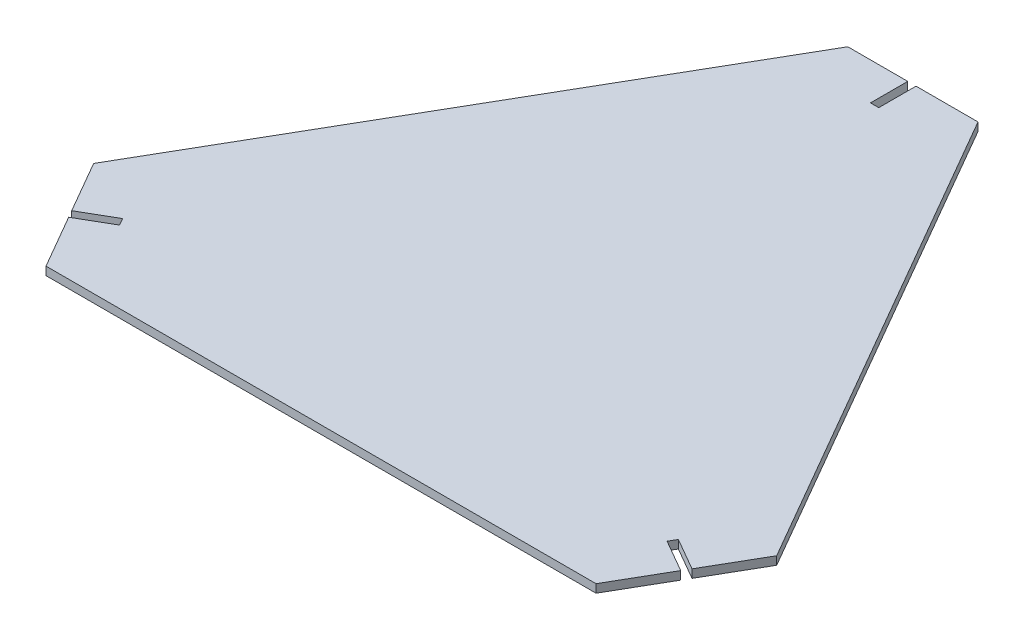
ISO-10303-21;
HEADER;
FILE_DESCRIPTION(('STEP AP214'),'2;1');
FILE_NAME('part.step','',(''),(''),'','','');
FILE_SCHEMA(('AUTOMOTIVE_DESIGN { 1 0 10303 214 1 1 1 1 }'));
ENDSEC;
DATA;
#1=APPLICATION_CONTEXT('core data for automotive mechanical design processes');
#2=APPLICATION_PROTOCOL_DEFINITION('international standard','automotive_design',2000,#1);
#3=PRODUCT_CONTEXT('',#1,'mechanical');
#4=PRODUCT('Part','Part','',(#3));
#5=PRODUCT_RELATED_PRODUCT_CATEGORY('part','',(#4));
#6=PRODUCT_DEFINITION_FORMATION('','',#4);
#7=PRODUCT_DEFINITION_CONTEXT('part definition',#1,'design');
#8=PRODUCT_DEFINITION('design','',#6,#7);
#9=PRODUCT_DEFINITION_SHAPE('','',#8);
#10=(LENGTH_UNIT() NAMED_UNIT(*) SI_UNIT(.MILLI.,.METRE.));
#11=(NAMED_UNIT(*) PLANE_ANGLE_UNIT() SI_UNIT($,.RADIAN.));
#12=(NAMED_UNIT(*) SI_UNIT($,.STERADIAN.) SOLID_ANGLE_UNIT());
#13=UNCERTAINTY_MEASURE_WITH_UNIT(LENGTH_MEASURE(1.E-05),#10,'distance_accuracy_value','');
#14=(GEOMETRIC_REPRESENTATION_CONTEXT(3) GLOBAL_UNCERTAINTY_ASSIGNED_CONTEXT((#13)) GLOBAL_UNIT_ASSIGNED_CONTEXT((#10,
#11,#12)) REPRESENTATION_CONTEXT('',''));
#15=CARTESIAN_POINT('',(0.,0.,0.));
#16=DIRECTION('',(0.,0.,1.));
#17=DIRECTION('',(1.,0.,0.));
#18=AXIS2_PLACEMENT_3D('',#15,#16,#17);
#19=CARTESIAN_POINT('',(112.583302491977,1.5,85.));
#20=DIRECTION('',(0.,0.,-1.));
#21=DIRECTION('',(-1.,0.,0.));
#22=AXIS2_PLACEMENT_3D('',#19,#20,#21);
#23=PLANE('',#22);
#24=DIRECTION('',(1.,0.,0.));
#25=VECTOR('',#24,1.);
#26=CARTESIAN_POINT('',(112.583302491977,1.5,85.));
#27=LINE('',#26,#25);
#28=CARTESIAN_POINT('',(-100.042489853198,1.5,85.));
#29=VERTEX_POINT('',#28);
#30=CARTESIAN_POINT('',(99.3042463006157,1.5,85.));
#31=VERTEX_POINT('',#30);
#32=EDGE_CURVE('E172',#29,#31,#27,.T.);
#33=ORIENTED_EDGE('',*,*,#32,.F.);
#34=DIRECTION('',(0.,1.,0.));
#35=VECTOR('',#34,1.);
#36=CARTESIAN_POINT('',(-100.042489853198,-1.501,85.));
#37=LINE('',#36,#35);
#38=CARTESIAN_POINT('',(-100.042489853198,-1.5,85.));
#39=VERTEX_POINT('',#38);
#40=EDGE_CURVE('E183',#39,#29,#37,.T.);
#41=ORIENTED_EDGE('',*,*,#40,.F.);
#42=DIRECTION('',(1.,0.,0.));
#43=VECTOR('',#42,1.);
#44=CARTESIAN_POINT('',(112.583302491977,-1.5,85.));
#45=LINE('',#44,#43);
#46=CARTESIAN_POINT('',(99.3042463006157,-1.5,85.));
#47=VERTEX_POINT('',#46);
#48=EDGE_CURVE('E209',#39,#47,#45,.T.);
#49=ORIENTED_EDGE('',*,*,#48,.T.);
#50=DIRECTION('',(0.,1.,0.));
#51=VECTOR('',#50,1.);
#52=CARTESIAN_POINT('',(99.3042463006157,-1.501,85.));
#53=LINE('',#52,#51);
#54=EDGE_CURVE('E194',#47,#31,#53,.T.);
#55=ORIENTED_EDGE('',*,*,#54,.T.);
#56=EDGE_LOOP('',(#33,#41,#49,#55));
#57=FACE_BOUND('',#56,.T.);
#58=ADVANCED_FACE('F40',(#57),#23,.F.);
#59=CARTESIAN_POINT('',(17.3205080756888,1.5,-140.));
#60=DIRECTION('',(-0.866025403784439,0.,0.5));
#61=DIRECTION('',(0.5,0.,0.866025403784439));
#62=AXIS2_PLACEMENT_3D('',#59,#60,#61);
#63=PLANE('',#62);
#64=DIRECTION('',(-0.5,0.,-0.866025403784438));
#65=VECTOR('',#64,1.);
#66=CARTESIAN_POINT('',(17.3205080756888,-1.5,-140.));
#67=LINE('',#66,#65);
#68=CARTESIAN_POINT('',(123.264282471985,-1.5,43.5));
#69=VERTEX_POINT('',#68);
#70=CARTESIAN_POINT('',(23.5909143950783,-1.5,-129.139337670716));
#71=VERTEX_POINT('',#70);
#72=EDGE_CURVE('E204',#69,#71,#67,.T.);
#73=ORIENTED_EDGE('',*,*,#72,.T.);
#74=DIRECTION('',(0.,1.,0.));
#75=VECTOR('',#74,1.);
#76=CARTESIAN_POINT('',(23.5909143950783,-1.501,-129.139337670716));
#77=LINE('',#76,#75);
#78=CARTESIAN_POINT('',(23.5909143950783,1.5,-129.139337670716));
#79=VERTEX_POINT('',#78);
#80=EDGE_CURVE('E190',#71,#79,#77,.T.);
#81=ORIENTED_EDGE('',*,*,#80,.T.);
#82=DIRECTION('',(-0.5,0.,-0.866025403784438));
#83=VECTOR('',#82,1.);
#84=CARTESIAN_POINT('',(17.3205080756888,1.5,-140.));
#85=LINE('',#84,#83);
#86=CARTESIAN_POINT('',(123.264282471985,1.5,43.5));
#87=VERTEX_POINT('',#86);
#88=EDGE_CURVE('E49',#87,#79,#85,.T.);
#89=ORIENTED_EDGE('',*,*,#88,.F.);
#90=DIRECTION('',(0.,1.,0.));
#91=VECTOR('',#90,1.);
#92=CARTESIAN_POINT('',(123.264282471985,-1.501,43.5));
#93=LINE('',#92,#91);
#94=EDGE_CURVE('E221',#69,#87,#93,.T.);
#95=ORIENTED_EDGE('',*,*,#94,.F.);
#96=EDGE_LOOP('',(#73,#81,#89,#95));
#97=FACE_BOUND('',#96,.T.);
#98=ADVANCED_FACE('F217',(#97),#63,.F.);
#99=CARTESIAN_POINT('',(-129.903810567666,1.5,55.));
#100=DIRECTION('',(0.866025403784439,0.,0.5));
#101=DIRECTION('',(0.5,0.,-0.866025403784439));
#102=AXIS2_PLACEMENT_3D('',#99,#100,#101);
#103=PLANE('',#102);
#104=DIRECTION('',(-0.5,0.,0.866025403784439));
#105=VECTOR('',#104,1.);
#106=CARTESIAN_POINT('',(-129.903810567666,-1.5,55.));
#107=LINE('',#106,#105);
#108=CARTESIAN_POINT('',(-23.5909143950782,-1.5,-129.139337670716));
#109=VERTEX_POINT('',#108);
#110=CARTESIAN_POINT('',(-123.633404248276,-1.5,44.1393376707166));
#111=VERTEX_POINT('',#110);
#112=EDGE_CURVE('E43',#109,#111,#107,.T.);
#113=ORIENTED_EDGE('',*,*,#112,.T.);
#114=DIRECTION('',(0.,1.,0.));
#115=VECTOR('',#114,1.);
#116=CARTESIAN_POINT('',(-123.633404248276,-1.501,44.1393376707166));
#117=LINE('',#116,#115);
#118=CARTESIAN_POINT('',(-123.633404248276,1.5,44.1393376707166));
#119=VERTEX_POINT('',#118);
#120=EDGE_CURVE('E276',#111,#119,#117,.T.);
#121=ORIENTED_EDGE('',*,*,#120,.T.);
#122=DIRECTION('',(-0.5,0.,0.866025403784439));
#123=VECTOR('',#122,1.);
#124=CARTESIAN_POINT('',(-129.903810567666,1.5,55.));
#125=LINE('',#124,#123);
#126=CARTESIAN_POINT('',(-23.5909143950782,1.5,-129.139337670716));
#127=VERTEX_POINT('',#126);
#128=EDGE_CURVE('E11',#127,#119,#125,.T.);
#129=ORIENTED_EDGE('',*,*,#128,.F.);
#130=DIRECTION('',(0.,1.,0.));
#131=VECTOR('',#130,1.);
#132=CARTESIAN_POINT('',(-23.5909143950782,-1.501,-129.139337670716));
#133=LINE('',#132,#131);
#134=EDGE_CURVE('E254',#109,#127,#133,.T.);
#135=ORIENTED_EDGE('',*,*,#134,.F.);
#136=EDGE_LOOP('',(#113,#121,#129,#135));
#137=FACE_BOUND('',#136,.T.);
#138=ADVANCED_FACE('F406',(#137),#103,.F.);
#139=CARTESIAN_POINT('',(-112.583302491977,1.5,65.));
#140=DIRECTION('',(0.,1.,0.));
#141=DIRECTION('',(0.,0.,1.));
#142=AXIS2_PLACEMENT_3D('',#139,#140,#141);
#143=PLANE('',#142);
#144=ORIENTED_EDGE('',*,*,#128,.T.);
#145=DIRECTION('',(-0.500000000000009,0.,-0.866025403784433));
#146=VECTOR('',#145,1.);
#147=CARTESIAN_POINT('',(-114.522507938882,1.5,59.9198729810788));
#148=LINE('',#147,#146);
#149=CARTESIAN_POINT('',(-112.772507938882,1.5,62.9509618943242));
#150=VERTEX_POINT('',#149);
#151=EDGE_CURVE('E180',#150,#119,#148,.T.);
#152=ORIENTED_EDGE('',*,*,#151,.F.);
#153=DIRECTION('',(-0.866025403784434,0.,0.500000000000008));
#154=VECTOR('',#153,1.);
#155=CARTESIAN_POINT('',(-101.081164987792,1.5,56.2009618943242));
#156=LINE('',#155,#154);
#157=CARTESIAN_POINT('',(-101.081164987792,1.5,56.2009618943242));
#158=VERTEX_POINT('',#157);
#159=EDGE_CURVE('E291',#158,#150,#156,.T.);
#160=ORIENTED_EDGE('',*,*,#159,.F.);
#161=DIRECTION('',(-0.500000000000006,0.,-0.866025403784435));
#162=VECTOR('',#161,1.);
#163=CARTESIAN_POINT('',(-99.5811649877924,1.5,58.7990381056775));
#164=LINE('',#163,#162);
#165=CARTESIAN_POINT('',(-99.5811649877924,1.5,58.7990381056775));
#166=VERTEX_POINT('',#165);
#167=EDGE_CURVE('E57',#166,#158,#164,.T.);
#168=ORIENTED_EDGE('',*,*,#167,.F.);
#169=DIRECTION('',(0.866025403784434,0.,-0.500000000000008));
#170=VECTOR('',#169,1.);
#171=CARTESIAN_POINT('',(-108.241419025637,1.5,63.7990381056776));
#172=LINE('',#171,#170);
#173=CARTESIAN_POINT('',(-111.272507938882,1.5,65.5490381056776));
#174=VERTEX_POINT('',#173);
#175=EDGE_CURVE('E174',#174,#166,#172,.T.);
#176=ORIENTED_EDGE('',*,*,#175,.F.);
#177=DIRECTION('',(-0.500000000000008,0.,-0.866025403784434));
#178=VECTOR('',#177,1.);
#179=CARTESIAN_POINT('',(-104.522507938882,1.5,77.2403810567675));
#180=LINE('',#179,#178);
#181=EDGE_CURVE('E167',#29,#174,#180,.T.);
#182=ORIENTED_EDGE('',*,*,#181,.F.);
#183=ORIENTED_EDGE('',*,*,#32,.T.);
#184=DIRECTION('',(-0.499999999999999,0.,0.866025403784439));
#185=VECTOR('',#184,1.);
#186=CARTESIAN_POINT('',(108.7842643863,1.5,68.5801270189222));
#187=LINE('',#186,#185);
#188=CARTESIAN_POINT('',(110.5342643863,1.5,65.5490381056767));
#189=VERTEX_POINT('',#188);
#190=EDGE_CURVE('E341',#189,#31,#187,.T.);
#191=ORIENTED_EDGE('',*,*,#190,.F.);
#192=DIRECTION('',(0.866025403784439,0.,0.5));
#193=VECTOR('',#192,1.);
#194=CARTESIAN_POINT('',(98.8429214352104,1.5,58.7990381056767));
#195=LINE('',#194,#193);
#196=CARTESIAN_POINT('',(98.8429214352104,1.5,58.7990381056767));
#197=VERTEX_POINT('',#196);
#198=EDGE_CURVE('E359',#197,#189,#195,.T.);
#199=ORIENTED_EDGE('',*,*,#198,.F.);
#200=DIRECTION('',(-0.500000000000002,0.,0.866025403784438));
#201=VECTOR('',#200,1.);
#202=CARTESIAN_POINT('',(100.34292143521,1.5,56.2009618943233));
#203=LINE('',#202,#201);
#204=CARTESIAN_POINT('',(100.34292143521,1.5,56.2009618943233));
#205=VERTEX_POINT('',#204);
#206=EDGE_CURVE('E356',#205,#197,#203,.T.);
#207=ORIENTED_EDGE('',*,*,#206,.F.);
#208=DIRECTION('',(-0.866025403784438,0.,-0.5));
#209=VECTOR('',#208,1.);
#210=CARTESIAN_POINT('',(109.003175473055,1.5,61.2009618943233));
#211=LINE('',#210,#209);
#212=CARTESIAN_POINT('',(112.0342643863,1.5,62.9509618943233));
#213=VERTEX_POINT('',#212);
#214=EDGE_CURVE('E362',#213,#205,#211,.T.);
#215=ORIENTED_EDGE('',*,*,#214,.F.);
#216=DIRECTION('',(-0.5,0.,0.866025403784439));
#217=VECTOR('',#216,1.);
#218=CARTESIAN_POINT('',(118.7842643863,1.5,51.2596189432334));
#219=LINE('',#218,#217);
#220=EDGE_CURVE('E337',#87,#213,#219,.T.);
#221=ORIENTED_EDGE('',*,*,#220,.F.);
#222=ORIENTED_EDGE('',*,*,#88,.T.);
#223=DIRECTION('',(1.,0.,0.));
#224=VECTOR('',#223,1.);
#225=CARTESIAN_POINT('',(4.63087822370822,1.5,-129.139337670717));
#226=LINE('',#225,#224);
#227=CARTESIAN_POINT('',(1.13087822370836,1.5,-129.139337670717));
#228=VERTEX_POINT('',#227);
#229=EDGE_CURVE('E237',#228,#79,#226,.T.);
#230=ORIENTED_EDGE('',*,*,#229,.F.);
#231=DIRECTION('',(0.,0.,-1.));
#232=VECTOR('',#231,1.);
#233=CARTESIAN_POINT('',(1.1308782237083,1.5,-115.639337670717));
#234=LINE('',#233,#232);
#235=CARTESIAN_POINT('',(1.13087822370829,1.5,-115.639337670717));
#236=VERTEX_POINT('',#235);
#237=EDGE_CURVE('E321',#236,#228,#234,.T.);
#238=ORIENTED_EDGE('',*,*,#237,.F.);
#239=DIRECTION('',(1.,0.,0.));
#240=VECTOR('',#239,1.);
#241=CARTESIAN_POINT('',(-1.86912177629171,1.5,-115.639337670717));
#242=LINE('',#241,#240);
#243=CARTESIAN_POINT('',(-1.86912177629171,1.5,-115.639337670717));
#244=VERTEX_POINT('',#243);
#245=EDGE_CURVE('E65',#244,#236,#242,.T.);
#246=ORIENTED_EDGE('',*,*,#245,.F.);
#247=DIRECTION('',(0.,0.,1.));
#248=VECTOR('',#247,1.);
#249=CARTESIAN_POINT('',(-1.86912177629177,1.5,-125.639337670717));
#250=LINE('',#249,#248);
#251=CARTESIAN_POINT('',(-1.86912177629177,1.5,-129.139337670716));
#252=VERTEX_POINT('',#251);
#253=EDGE_CURVE('E324',#252,#244,#250,.T.);
#254=ORIENTED_EDGE('',*,*,#253,.F.);
#255=DIRECTION('',(1.,0.,0.));
#256=VECTOR('',#255,1.);
#257=CARTESIAN_POINT('',(-15.3691217762918,1.5,-129.139337670716));
#258=LINE('',#257,#256);
#259=EDGE_CURVE('E281',#127,#252,#258,.T.);
#260=ORIENTED_EDGE('',*,*,#259,.F.);
#261=EDGE_LOOP('',(#144,#152,#160,#168,#176,#182,#183,#191,#199,#207,#215,#221,#222,#230,#238,
#246,#254,#260));
#262=FACE_BOUND('',#261,.T.);
#263=ADVANCED_FACE('F169',(#262),#143,.T.);
#264=CARTESIAN_POINT('',(-112.583302491977,-1.5,65.));
#265=DIRECTION('',(0.,1.,0.));
#266=DIRECTION('',(0.,0.,1.));
#267=AXIS2_PLACEMENT_3D('',#264,#265,#266);
#268=PLANE('',#267);
#269=DIRECTION('',(0.500000000000009,0.,0.866025403784433));
#270=VECTOR('',#269,1.);
#271=CARTESIAN_POINT('',(-114.522507938882,-1.5,59.9198729810788));
#272=LINE('',#271,#270);
#273=CARTESIAN_POINT('',(-112.772507938882,-1.5,62.9509618943242));
#274=VERTEX_POINT('',#273);
#275=EDGE_CURVE('E273',#111,#274,#272,.T.);
#276=ORIENTED_EDGE('',*,*,#275,.F.);
#277=ORIENTED_EDGE('',*,*,#112,.F.);
#278=DIRECTION('',(-1.,0.,0.));
#279=VECTOR('',#278,1.);
#280=CARTESIAN_POINT('',(-15.3691217762918,-1.5,-129.139337670716));
#281=LINE('',#280,#279);
#282=CARTESIAN_POINT('',(-1.86912177629177,-1.5,-129.139337670716));
#283=VERTEX_POINT('',#282);
#284=EDGE_CURVE('E309',#283,#109,#281,.T.);
#285=ORIENTED_EDGE('',*,*,#284,.F.);
#286=DIRECTION('',(0.,0.,-1.));
#287=VECTOR('',#286,1.);
#288=CARTESIAN_POINT('',(-1.86912177629177,-1.5,-125.639337670717));
#289=LINE('',#288,#287);
#290=CARTESIAN_POINT('',(-1.86912177629171,-1.5,-115.639337670717));
#291=VERTEX_POINT('',#290);
#292=EDGE_CURVE('E312',#291,#283,#289,.T.);
#293=ORIENTED_EDGE('',*,*,#292,.F.);
#294=DIRECTION('',(-1.,0.,0.));
#295=VECTOR('',#294,1.);
#296=CARTESIAN_POINT('',(-1.86912177629171,-1.5,-115.639337670717));
#297=LINE('',#296,#295);
#298=CARTESIAN_POINT('',(1.1308782237083,-1.5,-115.639337670717));
#299=VERTEX_POINT('',#298);
#300=EDGE_CURVE('E315',#299,#291,#297,.T.);
#301=ORIENTED_EDGE('',*,*,#300,.F.);
#302=DIRECTION('',(0.,0.,1.));
#303=VECTOR('',#302,1.);
#304=CARTESIAN_POINT('',(1.1308782237083,-1.5,-115.639337670717));
#305=LINE('',#304,#303);
#306=CARTESIAN_POINT('',(1.13087822370836,-1.5,-129.139337670717));
#307=VERTEX_POINT('',#306);
#308=EDGE_CURVE('E232',#307,#299,#305,.T.);
#309=ORIENTED_EDGE('',*,*,#308,.F.);
#310=DIRECTION('',(-1.,0.,0.));
#311=VECTOR('',#310,1.);
#312=CARTESIAN_POINT('',(4.63087822370822,-1.5,-129.139337670717));
#313=LINE('',#312,#311);
#314=EDGE_CURVE('E229',#71,#307,#313,.T.);
#315=ORIENTED_EDGE('',*,*,#314,.F.);
#316=ORIENTED_EDGE('',*,*,#72,.F.);
#317=DIRECTION('',(0.5,0.,-0.866025403784439));
#318=VECTOR('',#317,1.);
#319=CARTESIAN_POINT('',(118.7842643863,-1.5,51.2596189432334));
#320=LINE('',#319,#318);
#321=CARTESIAN_POINT('',(112.0342643863,-1.5,62.9509618943233));
#322=VERTEX_POINT('',#321);
#323=EDGE_CURVE('E226',#322,#69,#320,.T.);
#324=ORIENTED_EDGE('',*,*,#323,.F.);
#325=DIRECTION('',(0.866025403784439,0.,0.5));
#326=VECTOR('',#325,1.);
#327=CARTESIAN_POINT('',(109.003175473055,-1.5,61.2009618943233));
#328=LINE('',#327,#326);
#329=CARTESIAN_POINT('',(100.34292143521,-1.5,56.2009618943233));
#330=VERTEX_POINT('',#329);
#331=EDGE_CURVE('E344',#330,#322,#328,.T.);
#332=ORIENTED_EDGE('',*,*,#331,.F.);
#333=DIRECTION('',(0.500000000000002,0.,-0.866025403784437));
#334=VECTOR('',#333,1.);
#335=CARTESIAN_POINT('',(100.34292143521,-1.5,56.2009618943233));
#336=LINE('',#335,#334);
#337=CARTESIAN_POINT('',(98.8429214352104,-1.5,58.7990381056767));
#338=VERTEX_POINT('',#337);
#339=EDGE_CURVE('E352',#338,#330,#336,.T.);
#340=ORIENTED_EDGE('',*,*,#339,.F.);
#341=DIRECTION('',(-0.866025403784439,0.,-0.5));
#342=VECTOR('',#341,1.);
#343=CARTESIAN_POINT('',(98.8429214352104,-1.5,58.7990381056767));
#344=LINE('',#343,#342);
#345=CARTESIAN_POINT('',(110.5342643863,-1.5,65.5490381056767));
#346=VERTEX_POINT('',#345);
#347=EDGE_CURVE('E206',#346,#338,#344,.T.);
#348=ORIENTED_EDGE('',*,*,#347,.F.);
#349=DIRECTION('',(0.499999999999999,0.,-0.866025403784439));
#350=VECTOR('',#349,1.);
#351=CARTESIAN_POINT('',(108.7842643863,-1.5,68.5801270189222));
#352=LINE('',#351,#350);
#353=EDGE_CURVE('E336',#47,#346,#352,.T.);
#354=ORIENTED_EDGE('',*,*,#353,.F.);
#355=ORIENTED_EDGE('',*,*,#48,.F.);
#356=DIRECTION('',(0.500000000000008,0.,0.866025403784434));
#357=VECTOR('',#356,1.);
#358=CARTESIAN_POINT('',(-104.522507938882,-1.5,77.2403810567675));
#359=LINE('',#358,#357);
#360=CARTESIAN_POINT('',(-111.272507938882,-1.5,65.5490381056776));
#361=VERTEX_POINT('',#360);
#362=EDGE_CURVE('E179',#361,#39,#359,.T.);
#363=ORIENTED_EDGE('',*,*,#362,.F.);
#364=DIRECTION('',(-0.866025403784434,0.,0.500000000000008));
#365=VECTOR('',#364,1.);
#366=CARTESIAN_POINT('',(-108.241419025637,-1.5,63.7990381056776));
#367=LINE('',#366,#365);
#368=CARTESIAN_POINT('',(-99.5811649877924,-1.5,58.7990381056775));
#369=VERTEX_POINT('',#368);
#370=EDGE_CURVE('E272',#369,#361,#367,.T.);
#371=ORIENTED_EDGE('',*,*,#370,.F.);
#372=DIRECTION('',(0.500000000000006,0.,0.866025403784435));
#373=VECTOR('',#372,1.);
#374=CARTESIAN_POINT('',(-99.5811649877924,-1.5,58.7990381056775));
#375=LINE('',#374,#373);
#376=CARTESIAN_POINT('',(-101.081164987792,-1.5,56.2009618943242));
#377=VERTEX_POINT('',#376);
#378=EDGE_CURVE('E285',#377,#369,#375,.T.);
#379=ORIENTED_EDGE('',*,*,#378,.F.);
#380=DIRECTION('',(0.866025403784434,0.,-0.500000000000008));
#381=VECTOR('',#380,1.);
#382=CARTESIAN_POINT('',(-101.081164987792,-1.5,56.2009618943242));
#383=LINE('',#382,#381);
#384=EDGE_CURVE('E238',#274,#377,#383,.T.);
#385=ORIENTED_EDGE('',*,*,#384,.F.);
#386=EDGE_LOOP('',(#276,#277,#285,#293,#301,#309,#315,#316,#324,#332,#340,#348,#354,#355,#363,
#371,#379,#385));
#387=FACE_BOUND('',#386,.T.);
#388=ADVANCED_FACE('F224',(#387),#268,.F.);
#389=CARTESIAN_POINT('',(100.34292143521,-1.501,56.2009618943233));
#390=DIRECTION('',(-0.866025403784437,0.,-0.500000000000002));
#391=DIRECTION('',(-0.500000000000002,0.,0.866025403784437));
#392=AXIS2_PLACEMENT_3D('',#389,#390,#391);
#393=PLANE('',#392);
#394=ORIENTED_EDGE('',*,*,#339,.T.);
#395=DIRECTION('',(0.,1.,0.));
#396=VECTOR('',#395,1.);
#397=CARTESIAN_POINT('',(100.34292143521,-1.501,56.2009618943233));
#398=LINE('',#397,#396);
#399=EDGE_CURVE('E367',#330,#205,#398,.T.);
#400=ORIENTED_EDGE('',*,*,#399,.T.);
#401=ORIENTED_EDGE('',*,*,#206,.T.);
#402=DIRECTION('',(0.,1.,0.));
#403=VECTOR('',#402,1.);
#404=CARTESIAN_POINT('',(98.8429214352104,-1.501,58.7990381056767));
#405=LINE('',#404,#403);
#406=EDGE_CURVE('E366',#338,#197,#405,.T.);
#407=ORIENTED_EDGE('',*,*,#406,.F.);
#408=EDGE_LOOP('',(#394,#400,#401,#407));
#409=FACE_BOUND('',#408,.T.);
#410=ADVANCED_FACE('F385',(#409),#393,.F.);
#411=CARTESIAN_POINT('',(109.003175473055,-1.501,61.2009618943233));
#412=DIRECTION('',(0.5,0.,-0.866025403784438));
#413=DIRECTION('',(-0.866025403784439,0.,-0.5));
#414=AXIS2_PLACEMENT_3D('',#411,#412,#413);
#415=PLANE('',#414);
#416=ORIENTED_EDGE('',*,*,#331,.T.);
#417=DIRECTION('',(0.,1.,0.));
#418=VECTOR('',#417,1.);
#419=CARTESIAN_POINT('',(112.0342643863,-1.501,62.9509618943233));
#420=LINE('',#419,#418);
#421=EDGE_CURVE('E264',#322,#213,#420,.T.);
#422=ORIENTED_EDGE('',*,*,#421,.T.);
#423=ORIENTED_EDGE('',*,*,#214,.T.);
#424=ORIENTED_EDGE('',*,*,#399,.F.);
#425=EDGE_LOOP('',(#416,#422,#423,#424));
#426=FACE_BOUND('',#425,.T.);
#427=ADVANCED_FACE('F387',(#426),#415,.F.);
#428=CARTESIAN_POINT('',(98.8429214352104,-1.501,58.7990381056767));
#429=DIRECTION('',(-0.5,0.,0.866025403784439));
#430=DIRECTION('',(0.866025403784439,0.,0.5));
#431=AXIS2_PLACEMENT_3D('',#428,#429,#430);
#432=PLANE('',#431);
#433=ORIENTED_EDGE('',*,*,#347,.T.);
#434=ORIENTED_EDGE('',*,*,#406,.T.);
#435=ORIENTED_EDGE('',*,*,#198,.T.);
#436=DIRECTION('',(0.,1.,0.));
#437=VECTOR('',#436,1.);
#438=CARTESIAN_POINT('',(110.5342643863,-1.501,65.5490381056767));
#439=LINE('',#438,#437);
#440=EDGE_CURVE('E260',#346,#189,#439,.T.);
#441=ORIENTED_EDGE('',*,*,#440,.F.);
#442=EDGE_LOOP('',(#433,#434,#435,#441));
#443=FACE_BOUND('',#442,.T.);
#444=ADVANCED_FACE('F375',(#443),#432,.F.);
#445=CARTESIAN_POINT('',(118.7842643863,-1.501,51.2596189432334));
#446=DIRECTION('',(-0.866025403784439,0.,-0.5));
#447=DIRECTION('',(-0.5,0.,0.866025403784439));
#448=AXIS2_PLACEMENT_3D('',#445,#446,#447);
#449=PLANE('',#448);
#450=ORIENTED_EDGE('',*,*,#323,.T.);
#451=ORIENTED_EDGE('',*,*,#94,.T.);
#452=ORIENTED_EDGE('',*,*,#220,.T.);
#453=ORIENTED_EDGE('',*,*,#421,.F.);
#454=EDGE_LOOP('',(#450,#451,#452,#453));
#455=FACE_BOUND('',#454,.T.);
#456=ADVANCED_FACE('F389',(#455),#449,.F.);
#457=CARTESIAN_POINT('',(108.7842643863,-1.501,68.5801270189222));
#458=DIRECTION('',(-0.866025403784439,0.,-0.499999999999999));
#459=DIRECTION('',(-0.499999999999999,0.,0.866025403784439));
#460=AXIS2_PLACEMENT_3D('',#457,#458,#459);
#461=PLANE('',#460);
#462=ORIENTED_EDGE('',*,*,#353,.T.);
#463=ORIENTED_EDGE('',*,*,#440,.T.);
#464=ORIENTED_EDGE('',*,*,#190,.T.);
#465=ORIENTED_EDGE('',*,*,#54,.F.);
#466=EDGE_LOOP('',(#462,#463,#464,#465));
#467=FACE_BOUND('',#466,.T.);
#468=ADVANCED_FACE('F381',(#467),#461,.F.);
#469=CARTESIAN_POINT('',(-1.86912177629171,-1.501,-115.639337670717));
#470=DIRECTION('',(0.,0.,1.));
#471=DIRECTION('',(1.,0.,0.));
#472=AXIS2_PLACEMENT_3D('',#469,#470,#471);
#473=PLANE('',#472);
#474=ORIENTED_EDGE('',*,*,#300,.T.);
#475=DIRECTION('',(0.,1.,0.));
#476=VECTOR('',#475,1.);
#477=CARTESIAN_POINT('',(-1.86912177629171,-1.501,-115.639337670717));
#478=LINE('',#477,#476);
#479=EDGE_CURVE('E329',#291,#244,#478,.T.);
#480=ORIENTED_EDGE('',*,*,#479,.T.);
#481=ORIENTED_EDGE('',*,*,#245,.T.);
#482=DIRECTION('',(0.,1.,0.));
#483=VECTOR('',#482,1.);
#484=CARTESIAN_POINT('',(1.1308782237083,-1.501,-115.639337670717));
#485=LINE('',#484,#483);
#486=EDGE_CURVE('E328',#299,#236,#485,.T.);
#487=ORIENTED_EDGE('',*,*,#486,.F.);
#488=EDGE_LOOP('',(#474,#480,#481,#487));
#489=FACE_BOUND('',#488,.T.);
#490=ADVANCED_FACE('F393',(#489),#473,.F.);
#491=CARTESIAN_POINT('',(-1.86912177629177,-1.501,-125.639337670717));
#492=DIRECTION('',(-1.,0.,0.));
#493=DIRECTION('',(0.,0.,1.));
#494=AXIS2_PLACEMENT_3D('',#491,#492,#493);
#495=PLANE('',#494);
#496=ORIENTED_EDGE('',*,*,#292,.T.);
#497=DIRECTION('',(0.,1.,0.));
#498=VECTOR('',#497,1.);
#499=CARTESIAN_POINT('',(-1.86912177629177,-1.501,-129.139337670716));
#500=LINE('',#499,#498);
#501=EDGE_CURVE('E247',#283,#252,#500,.T.);
#502=ORIENTED_EDGE('',*,*,#501,.T.);
#503=ORIENTED_EDGE('',*,*,#253,.T.);
#504=ORIENTED_EDGE('',*,*,#479,.F.);
#505=EDGE_LOOP('',(#496,#502,#503,#504));
#506=FACE_BOUND('',#505,.T.);
#507=ADVANCED_FACE('F399',(#506),#495,.F.);
#508=CARTESIAN_POINT('',(1.1308782237083,-1.501,-115.639337670717));
#509=DIRECTION('',(1.,0.,0.));
#510=DIRECTION('',(0.,0.,-1.));
#511=AXIS2_PLACEMENT_3D('',#508,#509,#510);
#512=PLANE('',#511);
#513=ORIENTED_EDGE('',*,*,#308,.T.);
#514=ORIENTED_EDGE('',*,*,#486,.T.);
#515=ORIENTED_EDGE('',*,*,#237,.T.);
#516=DIRECTION('',(0.,1.,0.));
#517=VECTOR('',#516,1.);
#518=CARTESIAN_POINT('',(1.13087822370836,-1.501,-129.139337670717));
#519=LINE('',#518,#517);
#520=EDGE_CURVE('E243',#307,#228,#519,.T.);
#521=ORIENTED_EDGE('',*,*,#520,.F.);
#522=EDGE_LOOP('',(#513,#514,#515,#521));
#523=FACE_BOUND('',#522,.T.);
#524=ADVANCED_FACE('F392',(#523),#512,.F.);
#525=CARTESIAN_POINT('',(-114.522507938882,-1.501,59.9198729810788));
#526=DIRECTION('',(0.866025403784433,0.,-0.500000000000009));
#527=DIRECTION('',(-0.500000000000009,0.,-0.866025403784433));
#528=AXIS2_PLACEMENT_3D('',#525,#526,#527);
#529=PLANE('',#528);
#530=ORIENTED_EDGE('',*,*,#275,.T.);
#531=DIRECTION('',(0.,1.,0.));
#532=VECTOR('',#531,1.);
#533=CARTESIAN_POINT('',(-112.772507938882,-1.501,62.9509618943242));
#534=LINE('',#533,#532);
#535=EDGE_CURVE('E414',#274,#150,#534,.T.);
#536=ORIENTED_EDGE('',*,*,#535,.T.);
#537=ORIENTED_EDGE('',*,*,#151,.T.);
#538=ORIENTED_EDGE('',*,*,#120,.F.);
#539=EDGE_LOOP('',(#530,#536,#537,#538));
#540=FACE_BOUND('',#539,.T.);
#541=ADVANCED_FACE('F415',(#540),#529,.F.);
#542=CARTESIAN_POINT('',(-104.522507938882,-1.501,77.2403810567675));
#543=DIRECTION('',(0.866025403784434,0.,-0.500000000000008));
#544=DIRECTION('',(-0.500000000000008,0.,-0.866025403784434));
#545=AXIS2_PLACEMENT_3D('',#542,#543,#544);
#546=PLANE('',#545);
#547=ORIENTED_EDGE('',*,*,#362,.T.);
#548=ORIENTED_EDGE('',*,*,#40,.T.);
#549=ORIENTED_EDGE('',*,*,#181,.T.);
#550=DIRECTION('',(0.,1.,0.));
#551=VECTOR('',#550,1.);
#552=CARTESIAN_POINT('',(-111.272507938882,-1.501,65.5490381056776));
#553=LINE('',#552,#551);
#554=EDGE_CURVE('E189',#361,#174,#553,.T.);
#555=ORIENTED_EDGE('',*,*,#554,.F.);
#556=EDGE_LOOP('',(#547,#548,#549,#555));
#557=FACE_BOUND('',#556,.T.);
#558=ADVANCED_FACE('F184',(#557),#546,.F.);
#559=CARTESIAN_POINT('',(-15.3691217762918,-1.501,-129.139337670716));
#560=DIRECTION('',(0.,0.,1.));
#561=DIRECTION('',(1.,0.,0.));
#562=AXIS2_PLACEMENT_3D('',#559,#560,#561);
#563=PLANE('',#562);
#564=ORIENTED_EDGE('',*,*,#284,.T.);
#565=ORIENTED_EDGE('',*,*,#134,.T.);
#566=ORIENTED_EDGE('',*,*,#259,.T.);
#567=ORIENTED_EDGE('',*,*,#501,.F.);
#568=EDGE_LOOP('',(#564,#565,#566,#567));
#569=FACE_BOUND('',#568,.T.);
#570=ADVANCED_FACE('F401',(#569),#563,.F.);
#571=CARTESIAN_POINT('',(4.63087822370822,-1.501,-129.139337670717));
#572=DIRECTION('',(0.,0.,1.));
#573=DIRECTION('',(1.,0.,0.));
#574=AXIS2_PLACEMENT_3D('',#571,#572,#573);
#575=PLANE('',#574);
#576=ORIENTED_EDGE('',*,*,#314,.T.);
#577=ORIENTED_EDGE('',*,*,#520,.T.);
#578=ORIENTED_EDGE('',*,*,#229,.T.);
#579=ORIENTED_EDGE('',*,*,#80,.F.);
#580=EDGE_LOOP('',(#576,#577,#578,#579));
#581=FACE_BOUND('',#580,.T.);
#582=ADVANCED_FACE('F240',(#581),#575,.F.);
#583=CARTESIAN_POINT('',(-99.5811649877924,-1.501,58.7990381056775));
#584=DIRECTION('',(0.866025403784435,0.,-0.500000000000006));
#585=DIRECTION('',(-0.500000000000006,0.,-0.866025403784435));
#586=AXIS2_PLACEMENT_3D('',#583,#584,#585);
#587=PLANE('',#586);
#588=ORIENTED_EDGE('',*,*,#378,.T.);
#589=DIRECTION('',(0.,1.,0.));
#590=VECTOR('',#589,1.);
#591=CARTESIAN_POINT('',(-99.5811649877924,-1.501,58.7990381056775));
#592=LINE('',#591,#590);
#593=EDGE_CURVE('E298',#369,#166,#592,.T.);
#594=ORIENTED_EDGE('',*,*,#593,.T.);
#595=ORIENTED_EDGE('',*,*,#167,.T.);
#596=DIRECTION('',(0.,1.,0.));
#597=VECTOR('',#596,1.);
#598=CARTESIAN_POINT('',(-101.081164987792,-1.501,56.2009618943242));
#599=LINE('',#598,#597);
#600=EDGE_CURVE('E297',#377,#158,#599,.T.);
#601=ORIENTED_EDGE('',*,*,#600,.F.);
#602=EDGE_LOOP('',(#588,#594,#595,#601));
#603=FACE_BOUND('',#602,.T.);
#604=ADVANCED_FACE('F428',(#603),#587,.F.);
#605=CARTESIAN_POINT('',(-108.241419025637,-1.501,63.7990381056776));
#606=DIRECTION('',(0.500000000000008,0.,0.866025403784434));
#607=DIRECTION('',(0.866025403784434,0.,-0.500000000000008));
#608=AXIS2_PLACEMENT_3D('',#605,#606,#607);
#609=PLANE('',#608);
#610=ORIENTED_EDGE('',*,*,#370,.T.);
#611=ORIENTED_EDGE('',*,*,#554,.T.);
#612=ORIENTED_EDGE('',*,*,#175,.T.);
#613=ORIENTED_EDGE('',*,*,#593,.F.);
#614=EDGE_LOOP('',(#610,#611,#612,#613));
#615=FACE_BOUND('',#614,.T.);
#616=ADVANCED_FACE('F425',(#615),#609,.F.);
#617=CARTESIAN_POINT('',(-101.081164987792,-1.501,56.2009618943242));
#618=DIRECTION('',(-0.500000000000008,0.,-0.866025403784434));
#619=DIRECTION('',(-0.866025403784434,0.,0.500000000000008));
#620=AXIS2_PLACEMENT_3D('',#617,#618,#619);
#621=PLANE('',#620);
#622=ORIENTED_EDGE('',*,*,#384,.T.);
#623=ORIENTED_EDGE('',*,*,#600,.T.);
#624=ORIENTED_EDGE('',*,*,#159,.T.);
#625=ORIENTED_EDGE('',*,*,#535,.F.);
#626=EDGE_LOOP('',(#622,#623,#624,#625));
#627=FACE_BOUND('',#626,.T.);
#628=ADVANCED_FACE('F413',(#627),#621,.F.);
#629=CLOSED_SHELL('',(#58,#98,#138,#263,#388,#410,#427,#444,#456,#468,#490,#507,#524,#541,#558,
#570,#582,#604,#616,#628));
#630=MANIFOLD_SOLID_BREP('B2',#629);
#631=ADVANCED_BREP_SHAPE_REPRESENTATION('',(#18,#630),#14);
#632=SHAPE_DEFINITION_REPRESENTATION(#9,#631);
ENDSEC;
END-ISO-10303-21;
